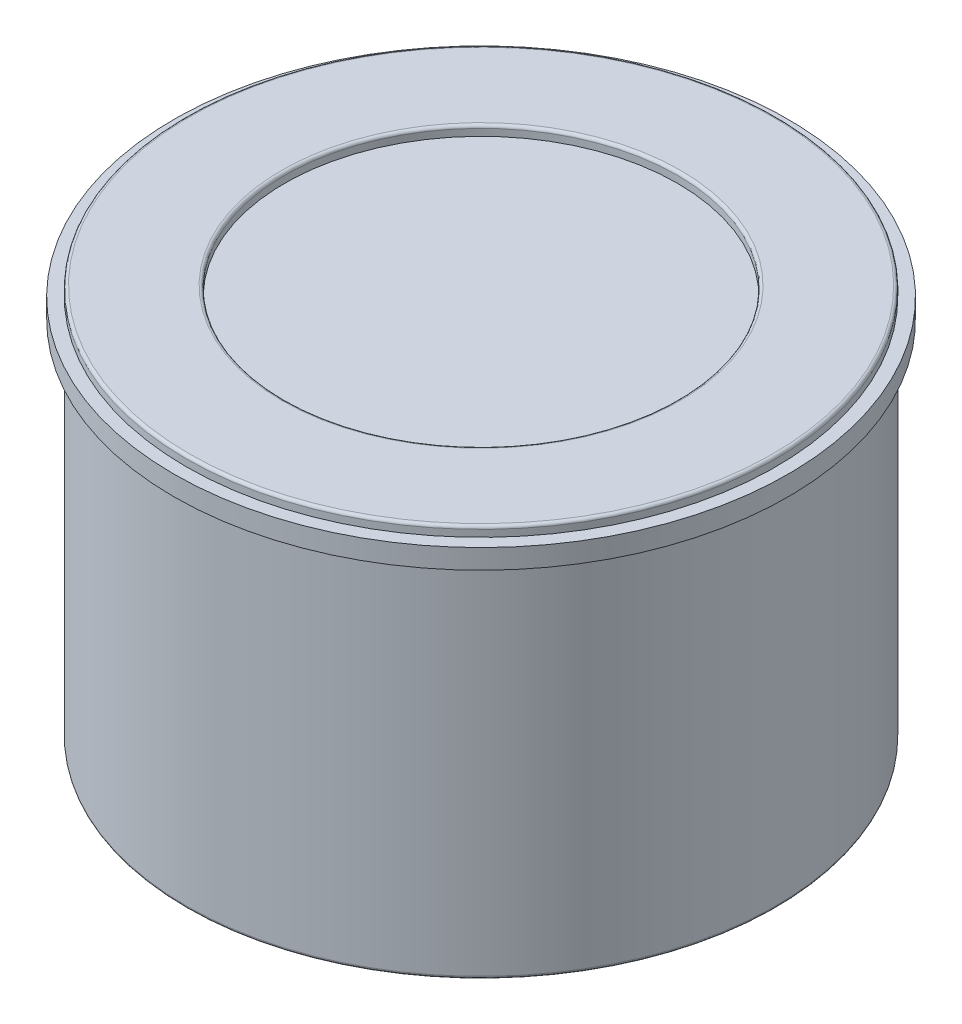
ISO-10303-21;
HEADER;
FILE_DESCRIPTION(('STEP AP214'),'2;1');
FILE_NAME('part.step','',(''),(''),'','','');
FILE_SCHEMA(('AUTOMOTIVE_DESIGN { 1 0 10303 214 1 1 1 1 }'));
ENDSEC;
DATA;
#1=APPLICATION_CONTEXT('core data for automotive mechanical design processes');
#2=APPLICATION_PROTOCOL_DEFINITION('international standard','automotive_design',2000,#1);
#3=PRODUCT_CONTEXT('',#1,'mechanical');
#4=PRODUCT('Part','Part','',(#3));
#5=PRODUCT_RELATED_PRODUCT_CATEGORY('part','',(#4));
#6=PRODUCT_DEFINITION_FORMATION('','',#4);
#7=PRODUCT_DEFINITION_CONTEXT('part definition',#1,'design');
#8=PRODUCT_DEFINITION('design','',#6,#7);
#9=PRODUCT_DEFINITION_SHAPE('','',#8);
#10=(LENGTH_UNIT() NAMED_UNIT(*) SI_UNIT(.MILLI.,.METRE.));
#11=(NAMED_UNIT(*) PLANE_ANGLE_UNIT() SI_UNIT($,.RADIAN.));
#12=(NAMED_UNIT(*) SI_UNIT($,.STERADIAN.) SOLID_ANGLE_UNIT());
#13=UNCERTAINTY_MEASURE_WITH_UNIT(LENGTH_MEASURE(1.E-05),#10,'distance_accuracy_value','');
#14=(GEOMETRIC_REPRESENTATION_CONTEXT(3) GLOBAL_UNCERTAINTY_ASSIGNED_CONTEXT((#13)) GLOBAL_UNIT_ASSIGNED_CONTEXT((#10,
#11,#12)) REPRESENTATION_CONTEXT('',''));
#15=CARTESIAN_POINT('',(0.,0.,0.));
#16=DIRECTION('',(0.,0.,1.));
#17=DIRECTION('',(1.,0.,0.));
#18=AXIS2_PLACEMENT_3D('',#15,#16,#17);
#19=CARTESIAN_POINT('',(0.,20.,0.));
#20=DIRECTION('',(0.,-1.,0.));
#21=DIRECTION('',(0.,0.,-1.));
#22=AXIS2_PLACEMENT_3D('',#19,#20,#21);
#23=CYLINDRICAL_SURFACE('',#22,15.);
#24=CARTESIAN_POINT('',(0.,0.150000000000001,0.));
#25=DIRECTION('',(0.,1.,0.));
#26=DIRECTION('',(0.,0.,1.));
#27=AXIS2_PLACEMENT_3D('',#24,#25,#26);
#28=CIRCLE('',#27,15.);
#29=CARTESIAN_POINT('',(0.,0.150000000000001,15.));
#30=VERTEX_POINT('',#29);
#31=EDGE_CURVE('E141',#30,#30,#28,.T.);
#32=ORIENTED_EDGE('',*,*,#31,.T.);
#33=EDGE_LOOP('',(#32));
#34=FACE_BOUND('',#33,.T.);
#35=CARTESIAN_POINT('',(0.,18.5,0.));
#36=DIRECTION('',(0.,1.,0.));
#37=DIRECTION('',(0.,0.,1.));
#38=AXIS2_PLACEMENT_3D('',#35,#36,#37);
#39=CIRCLE('',#38,15.);
#40=CARTESIAN_POINT('',(0.,18.5,15.));
#41=VERTEX_POINT('',#40);
#42=EDGE_CURVE('E11',#41,#41,#39,.T.);
#43=ORIENTED_EDGE('',*,*,#42,.F.);
#44=EDGE_LOOP('',(#43));
#45=FACE_BOUND('',#44,.T.);
#46=ADVANCED_FACE('F36',(#34,#45),#23,.T.);
#47=CARTESIAN_POINT('',(0.,2.99999999999999,0.));
#48=DIRECTION('',(0.,-1.,0.));
#49=DIRECTION('',(0.,0.,-1.));
#50=AXIS2_PLACEMENT_3D('',#47,#48,#49);
#51=PLANE('',#50);
#52=CARTESIAN_POINT('',(0.,2.99999999999999,0.));
#53=DIRECTION('',(0.,-1.,0.));
#54=DIRECTION('',(0.,0.,-1.));
#55=AXIS2_PLACEMENT_3D('',#52,#53,#54);
#56=CIRCLE('',#55,10.);
#57=CARTESIAN_POINT('',(0.,2.99999999999999,-10.));
#58=VERTEX_POINT('',#57);
#59=EDGE_CURVE('E99',#58,#58,#56,.T.);
#60=ORIENTED_EDGE('',*,*,#59,.T.);
#61=EDGE_LOOP('',(#60));
#62=FACE_BOUND('',#61,.T.);
#63=DIRECTION('',(-1.,0.,0.));
#64=VECTOR('',#63,1.);
#65=CARTESIAN_POINT('',(-2.,2.99999999999999,2.));
#66=LINE('',#65,#64);
#67=CARTESIAN_POINT('',(2.,2.99999999999999,2.));
#68=VERTEX_POINT('',#67);
#69=CARTESIAN_POINT('',(-2.,2.99999999999999,2.));
#70=VERTEX_POINT('',#69);
#71=EDGE_CURVE('E94',#68,#70,#66,.T.);
#72=ORIENTED_EDGE('',*,*,#71,.F.);
#73=DIRECTION('',(0.,0.,1.));
#74=VECTOR('',#73,1.);
#75=CARTESIAN_POINT('',(2.,2.99999999999999,2.));
#76=LINE('',#75,#74);
#77=CARTESIAN_POINT('',(2.,2.99999999999999,-2.));
#78=VERTEX_POINT('',#77);
#79=EDGE_CURVE('E103',#78,#68,#76,.T.);
#80=ORIENTED_EDGE('',*,*,#79,.F.);
#81=DIRECTION('',(1.,0.,0.));
#82=VECTOR('',#81,1.);
#83=CARTESIAN_POINT('',(-2.,2.99999999999999,-2.));
#84=LINE('',#83,#82);
#85=CARTESIAN_POINT('',(-2.,2.99999999999999,-2.));
#86=VERTEX_POINT('',#85);
#87=EDGE_CURVE('E116',#86,#78,#84,.T.);
#88=ORIENTED_EDGE('',*,*,#87,.F.);
#89=DIRECTION('',(0.,0.,-1.));
#90=VECTOR('',#89,1.);
#91=CARTESIAN_POINT('',(-2.,2.99999999999999,2.));
#92=LINE('',#91,#90);
#93=EDGE_CURVE('E114',#70,#86,#92,.T.);
#94=ORIENTED_EDGE('',*,*,#93,.F.);
#95=EDGE_LOOP('',(#72,#80,#88,#94));
#96=FACE_BOUND('',#95,.T.);
#97=ADVANCED_FACE('F112',(#62,#96),#51,.T.);
#98=CARTESIAN_POINT('',(0.,0.,0.));
#99=DIRECTION('',(0.,1.,0.));
#100=DIRECTION('',(0.,0.,1.));
#101=AXIS2_PLACEMENT_3D('',#98,#99,#100);
#102=PLANE('',#101);
#103=CARTESIAN_POINT('',(0.,0.,0.));
#104=DIRECTION('',(0.,1.,0.));
#105=DIRECTION('',(0.,0.,1.));
#106=AXIS2_PLACEMENT_3D('',#103,#104,#105);
#107=CIRCLE('',#106,14.85);
#108=CARTESIAN_POINT('',(0.,0.,14.85));
#109=VERTEX_POINT('',#108);
#110=EDGE_CURVE('E150',#109,#109,#107,.F.);
#111=ORIENTED_EDGE('',*,*,#110,.T.);
#112=EDGE_LOOP('',(#111));
#113=FACE_BOUND('',#112,.T.);
#114=CARTESIAN_POINT('',(0.,0.,0.));
#115=DIRECTION('',(0.,1.,0.));
#116=DIRECTION('',(0.,0.,1.));
#117=AXIS2_PLACEMENT_3D('',#114,#115,#116);
#118=CIRCLE('',#117,10.15);
#119=CARTESIAN_POINT('',(0.,0.,10.15));
#120=VERTEX_POINT('',#119);
#121=EDGE_CURVE('E147',#120,#120,#118,.T.);
#122=ORIENTED_EDGE('',*,*,#121,.T.);
#123=EDGE_LOOP('',(#122));
#124=FACE_BOUND('',#123,.T.);
#125=ADVANCED_FACE('F218',(#113,#124),#102,.F.);
#126=CARTESIAN_POINT('',(0.,2.99999999999999,0.));
#127=DIRECTION('',(0.,-1.,0.));
#128=DIRECTION('',(0.,0.,-1.));
#129=AXIS2_PLACEMENT_3D('',#126,#127,#128);
#130=CYLINDRICAL_SURFACE('',#129,10.);
#131=CARTESIAN_POINT('',(0.,0.15,0.));
#132=DIRECTION('',(0.,1.,0.));
#133=DIRECTION('',(0.,0.,1.));
#134=AXIS2_PLACEMENT_3D('',#131,#132,#133);
#135=CIRCLE('',#134,10.);
#136=CARTESIAN_POINT('',(0.,0.15,10.));
#137=VERTEX_POINT('',#136);
#138=EDGE_CURVE('E153',#137,#137,#135,.F.);
#139=ORIENTED_EDGE('',*,*,#138,.T.);
#140=EDGE_LOOP('',(#139));
#141=FACE_BOUND('',#140,.T.);
#142=ORIENTED_EDGE('',*,*,#59,.F.);
#143=EDGE_LOOP('',(#142));
#144=FACE_BOUND('',#143,.T.);
#145=ADVANCED_FACE('F264',(#141,#144),#130,.F.);
#146=CARTESIAN_POINT('',(2.,-4.,2.));
#147=DIRECTION('',(-1.,0.,0.));
#148=DIRECTION('',(0.,0.,1.));
#149=AXIS2_PLACEMENT_3D('',#146,#147,#148);
#150=PLANE('',#149);
#151=CARTESIAN_POINT('',(2.,-2.,0.));
#152=DIRECTION('',(1.,0.,0.));
#153=DIRECTION('',(0.,0.,-1.));
#154=AXIS2_PLACEMENT_3D('',#151,#152,#153);
#155=CIRCLE('',#154,1.5);
#156=CARTESIAN_POINT('',(2.,-2.,-1.49999999999999));
#157=VERTEX_POINT('',#156);
#158=EDGE_CURVE('E132',#157,#157,#155,.T.);
#159=ORIENTED_EDGE('',*,*,#158,.F.);
#160=EDGE_LOOP('',(#159));
#161=FACE_BOUND('',#160,.T.);
#162=DIRECTION('',(0.,0.,1.));
#163=VECTOR('',#162,1.);
#164=CARTESIAN_POINT('',(2.,-4.,2.));
#165=LINE('',#164,#163);
#166=CARTESIAN_POINT('',(2.,-4.,-1.85));
#167=VERTEX_POINT('',#166);
#168=CARTESIAN_POINT('',(2.,-4.,1.85));
#169=VERTEX_POINT('',#168);
#170=EDGE_CURVE('E121',#167,#169,#165,.T.);
#171=ORIENTED_EDGE('',*,*,#170,.F.);
#172=CARTESIAN_POINT('',(2.,-3.85,-1.85));
#173=DIRECTION('',(-1.,0.,0.));
#174=DIRECTION('',(0.,0.,1.));
#175=AXIS2_PLACEMENT_3D('',#172,#173,#174);
#176=CIRCLE('',#175,0.15);
#177=CARTESIAN_POINT('',(2.,-3.85,-2.));
#178=VERTEX_POINT('',#177);
#179=EDGE_CURVE('E164',#167,#178,#176,.F.);
#180=ORIENTED_EDGE('',*,*,#179,.T.);
#181=DIRECTION('',(0.,1.,0.));
#182=VECTOR('',#181,1.);
#183=CARTESIAN_POINT('',(2.,-4.,-2.));
#184=LINE('',#183,#182);
#185=EDGE_CURVE('E106',#178,#78,#184,.T.);
#186=ORIENTED_EDGE('',*,*,#185,.T.);
#187=ORIENTED_EDGE('',*,*,#79,.T.);
#188=DIRECTION('',(0.,1.,0.));
#189=VECTOR('',#188,1.);
#190=CARTESIAN_POINT('',(2.,-4.,2.));
#191=LINE('',#190,#189);
#192=CARTESIAN_POINT('',(2.,-3.85,2.));
#193=VERTEX_POINT('',#192);
#194=EDGE_CURVE('E90',#193,#68,#191,.T.);
#195=ORIENTED_EDGE('',*,*,#194,.F.);
#196=CARTESIAN_POINT('',(2.,-3.85,1.85));
#197=DIRECTION('',(-1.,0.,0.));
#198=DIRECTION('',(0.,0.,1.));
#199=AXIS2_PLACEMENT_3D('',#196,#197,#198);
#200=CIRCLE('',#199,0.15);
#201=EDGE_CURVE('E162',#193,#169,#200,.F.);
#202=ORIENTED_EDGE('',*,*,#201,.T.);
#203=EDGE_LOOP('',(#171,#180,#186,#187,#195,#202));
#204=FACE_BOUND('',#203,.T.);
#205=ADVANCED_FACE('F105',(#161,#204),#150,.F.);
#206=CARTESIAN_POINT('',(-2.,-4.,2.));
#207=DIRECTION('',(0.,0.,-1.));
#208=DIRECTION('',(-1.,0.,0.));
#209=AXIS2_PLACEMENT_3D('',#206,#207,#208);
#210=PLANE('',#209);
#211=DIRECTION('',(0.,1.,0.));
#212=VECTOR('',#211,1.);
#213=CARTESIAN_POINT('',(-2.,-4.,2.));
#214=LINE('',#213,#212);
#215=CARTESIAN_POINT('',(-2.,-3.85,2.));
#216=VERTEX_POINT('',#215);
#217=EDGE_CURVE('E100',#216,#70,#214,.T.);
#218=ORIENTED_EDGE('',*,*,#217,.F.);
#219=DIRECTION('',(-1.,0.,0.));
#220=VECTOR('',#219,1.);
#221=CARTESIAN_POINT('',(2.,-3.85,2.));
#222=LINE('',#221,#220);
#223=EDGE_CURVE('E44',#216,#193,#222,.F.);
#224=ORIENTED_EDGE('',*,*,#223,.T.);
#225=ORIENTED_EDGE('',*,*,#194,.T.);
#226=ORIENTED_EDGE('',*,*,#71,.T.);
#227=EDGE_LOOP('',(#218,#224,#225,#226));
#228=FACE_BOUND('',#227,.T.);
#229=ADVANCED_FACE('F92',(#228),#210,.F.);
#230=CARTESIAN_POINT('',(-2.,-4.,2.));
#231=DIRECTION('',(1.,0.,0.));
#232=DIRECTION('',(0.,0.,-1.));
#233=AXIS2_PLACEMENT_3D('',#230,#231,#232);
#234=PLANE('',#233);
#235=CARTESIAN_POINT('',(-2.,-2.,0.));
#236=DIRECTION('',(1.,0.,0.));
#237=DIRECTION('',(0.,0.,-1.));
#238=AXIS2_PLACEMENT_3D('',#235,#236,#237);
#239=CIRCLE('',#238,1.5);
#240=CARTESIAN_POINT('',(-2.,-2.,-1.49999999999999));
#241=VERTEX_POINT('',#240);
#242=EDGE_CURVE('E110',#241,#241,#239,.T.);
#243=ORIENTED_EDGE('',*,*,#242,.T.);
#244=EDGE_LOOP('',(#243));
#245=FACE_BOUND('',#244,.T.);
#246=DIRECTION('',(0.,1.,0.));
#247=VECTOR('',#246,1.);
#248=CARTESIAN_POINT('',(-2.,-4.,-2.));
#249=LINE('',#248,#247);
#250=CARTESIAN_POINT('',(-2.,-3.85,-2.));
#251=VERTEX_POINT('',#250);
#252=EDGE_CURVE('E123',#251,#86,#249,.T.);
#253=ORIENTED_EDGE('',*,*,#252,.F.);
#254=CARTESIAN_POINT('',(-2.,-3.85,-1.85));
#255=DIRECTION('',(1.,0.,0.));
#256=DIRECTION('',(0.,0.,-1.));
#257=AXIS2_PLACEMENT_3D('',#254,#255,#256);
#258=CIRCLE('',#257,0.15);
#259=CARTESIAN_POINT('',(-2.,-4.,-1.85));
#260=VERTEX_POINT('',#259);
#261=EDGE_CURVE('E168',#251,#260,#258,.F.);
#262=ORIENTED_EDGE('',*,*,#261,.T.);
#263=DIRECTION('',(0.,0.,-1.));
#264=VECTOR('',#263,1.);
#265=CARTESIAN_POINT('',(-2.,-4.,2.));
#266=LINE('',#265,#264);
#267=CARTESIAN_POINT('',(-2.,-4.,1.85));
#268=VERTEX_POINT('',#267);
#269=EDGE_CURVE('E124',#268,#260,#266,.T.);
#270=ORIENTED_EDGE('',*,*,#269,.F.);
#271=CARTESIAN_POINT('',(-2.,-3.85,1.85));
#272=DIRECTION('',(1.,0.,0.));
#273=DIRECTION('',(0.,0.,-1.));
#274=AXIS2_PLACEMENT_3D('',#271,#272,#273);
#275=CIRCLE('',#274,0.15);
#276=EDGE_CURVE('E51',#268,#216,#275,.F.);
#277=ORIENTED_EDGE('',*,*,#276,.T.);
#278=ORIENTED_EDGE('',*,*,#217,.T.);
#279=ORIENTED_EDGE('',*,*,#93,.T.);
#280=EDGE_LOOP('',(#253,#262,#270,#277,#278,#279));
#281=FACE_BOUND('',#280,.T.);
#282=ADVANCED_FACE('F198',(#245,#281),#234,.F.);
#283=CARTESIAN_POINT('',(-2.,-4.,-2.));
#284=DIRECTION('',(0.,0.,1.));
#285=DIRECTION('',(1.,0.,0.));
#286=AXIS2_PLACEMENT_3D('',#283,#284,#285);
#287=PLANE('',#286);
#288=ORIENTED_EDGE('',*,*,#185,.F.);
#289=DIRECTION('',(1.,0.,0.));
#290=VECTOR('',#289,1.);
#291=CARTESIAN_POINT('',(-2.,-3.85,-2.));
#292=LINE('',#291,#290);
#293=EDGE_CURVE('E59',#178,#251,#292,.F.);
#294=ORIENTED_EDGE('',*,*,#293,.T.);
#295=ORIENTED_EDGE('',*,*,#252,.T.);
#296=ORIENTED_EDGE('',*,*,#87,.T.);
#297=EDGE_LOOP('',(#288,#294,#295,#296));
#298=FACE_BOUND('',#297,.T.);
#299=ADVANCED_FACE('F197',(#298),#287,.F.);
#300=CARTESIAN_POINT('',(0.,-4.,0.));
#301=DIRECTION('',(0.,-1.,0.));
#302=DIRECTION('',(0.,0.,-1.));
#303=AXIS2_PLACEMENT_3D('',#300,#301,#302);
#304=PLANE('',#303);
#305=ORIENTED_EDGE('',*,*,#269,.T.);
#306=DIRECTION('',(1.,0.,0.));
#307=VECTOR('',#306,1.);
#308=CARTESIAN_POINT('',(2.,-4.,-1.85));
#309=LINE('',#308,#307);
#310=EDGE_CURVE('E159',#260,#167,#309,.T.);
#311=ORIENTED_EDGE('',*,*,#310,.T.);
#312=ORIENTED_EDGE('',*,*,#170,.T.);
#313=DIRECTION('',(-1.,0.,0.));
#314=VECTOR('',#313,1.);
#315=CARTESIAN_POINT('',(-2.,-4.,1.85));
#316=LINE('',#315,#314);
#317=EDGE_CURVE('E156',#169,#268,#316,.T.);
#318=ORIENTED_EDGE('',*,*,#317,.T.);
#319=EDGE_LOOP('',(#305,#311,#312,#318));
#320=FACE_BOUND('',#319,.T.);
#321=ADVANCED_FACE('F192',(#320),#304,.T.);
#322=CARTESIAN_POINT('',(-4.99999999999999,-2.,0.));
#323=DIRECTION('',(1.,0.,0.));
#324=DIRECTION('',(0.,0.,-1.));
#325=AXIS2_PLACEMENT_3D('',#322,#323,#324);
#326=CYLINDRICAL_SURFACE('',#325,1.5);
#327=ORIENTED_EDGE('',*,*,#158,.T.);
#328=EDGE_LOOP('',(#327));
#329=FACE_BOUND('',#328,.T.);
#330=ORIENTED_EDGE('',*,*,#242,.F.);
#331=EDGE_LOOP('',(#330));
#332=FACE_BOUND('',#331,.T.);
#333=ADVANCED_FACE('F254',(#329,#332),#326,.F.);
#334=CARTESIAN_POINT('',(0.,0.150000000000001,0.));
#335=DIRECTION('',(0.,1.,0.));
#336=DIRECTION('',(0.,0.,1.));
#337=AXIS2_PLACEMENT_3D('',#334,#335,#336);
#338=TOROIDAL_SURFACE('',#337,14.85,0.15);
#339=ORIENTED_EDGE('',*,*,#110,.F.);
#340=EDGE_LOOP('',(#339));
#341=FACE_BOUND('',#340,.T.);
#342=ORIENTED_EDGE('',*,*,#31,.F.);
#343=EDGE_LOOP('',(#342));
#344=FACE_BOUND('',#343,.T.);
#345=ADVANCED_FACE('F251',(#341,#344),#338,.T.);
#346=CARTESIAN_POINT('',(0.,0.15,0.));
#347=DIRECTION('',(0.,1.,0.));
#348=DIRECTION('',(0.,0.,1.));
#349=AXIS2_PLACEMENT_3D('',#346,#347,#348);
#350=TOROIDAL_SURFACE('',#349,10.15,0.15);
#351=ORIENTED_EDGE('',*,*,#121,.F.);
#352=EDGE_LOOP('',(#351));
#353=FACE_BOUND('',#352,.T.);
#354=ORIENTED_EDGE('',*,*,#138,.F.);
#355=EDGE_LOOP('',(#354));
#356=FACE_BOUND('',#355,.T.);
#357=ADVANCED_FACE('F210',(#353,#356),#350,.T.);
#358=CARTESIAN_POINT('',(0.,-3.85,-1.85));
#359=DIRECTION('',(-1.,0.,0.));
#360=DIRECTION('',(0.,0.,1.));
#361=AXIS2_PLACEMENT_3D('',#358,#359,#360);
#362=CYLINDRICAL_SURFACE('',#361,0.15);
#363=ORIENTED_EDGE('',*,*,#261,.F.);
#364=ORIENTED_EDGE('',*,*,#293,.F.);
#365=ORIENTED_EDGE('',*,*,#179,.F.);
#366=ORIENTED_EDGE('',*,*,#310,.F.);
#367=EDGE_LOOP('',(#363,#364,#365,#366));
#368=FACE_BOUND('',#367,.T.);
#369=ADVANCED_FACE('F196',(#368),#362,.T.);
#370=CARTESIAN_POINT('',(0.,-3.85,1.85));
#371=DIRECTION('',(1.,0.,0.));
#372=DIRECTION('',(0.,0.,-1.));
#373=AXIS2_PLACEMENT_3D('',#370,#371,#372);
#374=CYLINDRICAL_SURFACE('',#373,0.15);
#375=ORIENTED_EDGE('',*,*,#201,.F.);
#376=ORIENTED_EDGE('',*,*,#223,.F.);
#377=ORIENTED_EDGE('',*,*,#276,.F.);
#378=ORIENTED_EDGE('',*,*,#317,.F.);
#379=EDGE_LOOP('',(#375,#376,#377,#378));
#380=FACE_BOUND('',#379,.T.);
#381=ADVANCED_FACE('F38',(#380),#374,.T.);
#382=CARTESIAN_POINT('',(0.,19.5,0.));
#383=DIRECTION('',(0.,1.,0.));
#384=DIRECTION('',(0.,0.,1.));
#385=AXIS2_PLACEMENT_3D('',#382,#383,#384);
#386=PLANE('',#385);
#387=CARTESIAN_POINT('',(0.,19.5,0.));
#388=DIRECTION('',(0.,1.,0.));
#389=DIRECTION('',(0.,0.,1.));
#390=AXIS2_PLACEMENT_3D('',#387,#388,#389);
#391=CIRCLE('',#390,15.6367101872443);
#392=CARTESIAN_POINT('',(0.,19.5,15.6367101872443));
#393=VERTEX_POINT('',#392);
#394=EDGE_CURVE('E179',#393,#393,#391,.T.);
#395=ORIENTED_EDGE('',*,*,#394,.T.);
#396=EDGE_LOOP('',(#395));
#397=FACE_BOUND('',#396,.T.);
#398=CARTESIAN_POINT('',(0.,19.5,0.));
#399=DIRECTION('',(0.,1.,0.));
#400=DIRECTION('',(0.,0.,1.));
#401=AXIS2_PLACEMENT_3D('',#398,#399,#400);
#402=CIRCLE('',#401,15.);
#403=CARTESIAN_POINT('',(0.,19.5,15.));
#404=VERTEX_POINT('',#403);
#405=EDGE_CURVE('E172',#404,#404,#402,.T.);
#406=ORIENTED_EDGE('',*,*,#405,.F.);
#407=EDGE_LOOP('',(#406));
#408=FACE_BOUND('',#407,.T.);
#409=ADVANCED_FACE('F201',(#397,#408),#386,.T.);
#410=CARTESIAN_POINT('',(0.,18.5,0.));
#411=DIRECTION('',(0.,1.,0.));
#412=DIRECTION('',(0.,0.,1.));
#413=AXIS2_PLACEMENT_3D('',#410,#411,#412);
#414=CYLINDRICAL_SURFACE('',#413,15.6367101872443);
#415=CARTESIAN_POINT('',(0.,18.5,0.));
#416=DIRECTION('',(0.,1.,0.));
#417=DIRECTION('',(0.,0.,1.));
#418=AXIS2_PLACEMENT_3D('',#415,#416,#417);
#419=CIRCLE('',#418,15.6367101872443);
#420=CARTESIAN_POINT('',(0.,18.5,15.6367101872443));
#421=VERTEX_POINT('',#420);
#422=EDGE_CURVE('E173',#421,#421,#419,.T.);
#423=ORIENTED_EDGE('',*,*,#422,.T.);
#424=EDGE_LOOP('',(#423));
#425=FACE_BOUND('',#424,.T.);
#426=ORIENTED_EDGE('',*,*,#394,.F.);
#427=EDGE_LOOP('',(#426));
#428=FACE_BOUND('',#427,.T.);
#429=ADVANCED_FACE('F206',(#425,#428),#414,.T.);
#430=CARTESIAN_POINT('',(0.,18.5,0.));
#431=DIRECTION('',(0.,1.,0.));
#432=DIRECTION('',(0.,0.,1.));
#433=AXIS2_PLACEMENT_3D('',#430,#431,#432);
#434=PLANE('',#433);
#435=ORIENTED_EDGE('',*,*,#42,.T.);
#436=EDGE_LOOP('',(#435));
#437=FACE_BOUND('',#436,.T.);
#438=ORIENTED_EDGE('',*,*,#422,.F.);
#439=EDGE_LOOP('',(#438));
#440=FACE_BOUND('',#439,.T.);
#441=ADVANCED_FACE('F235',(#437,#440),#434,.F.);
#442=CARTESIAN_POINT('',(0.,19.85,0.));
#443=DIRECTION('',(0.,1.,0.));
#444=DIRECTION('',(0.,0.,1.));
#445=AXIS2_PLACEMENT_3D('',#442,#443,#444);
#446=TOROIDAL_SURFACE('',#445,14.85,0.15);
#447=CARTESIAN_POINT('',(0.,19.85,0.));
#448=DIRECTION('',(0.,1.,0.));
#449=DIRECTION('',(0.,0.,1.));
#450=AXIS2_PLACEMENT_3D('',#447,#448,#449);
#451=CIRCLE('',#450,15.);
#452=CARTESIAN_POINT('',(0.,19.85,15.));
#453=VERTEX_POINT('',#452);
#454=EDGE_CURVE('E144',#453,#453,#451,.F.);
#455=ORIENTED_EDGE('',*,*,#454,.F.);
#456=EDGE_LOOP('',(#455));
#457=FACE_BOUND('',#456,.T.);
#458=CARTESIAN_POINT('',(0.,20.,0.));
#459=DIRECTION('',(0.,1.,0.));
#460=DIRECTION('',(0.,0.,1.));
#461=AXIS2_PLACEMENT_3D('',#458,#459,#460);
#462=CIRCLE('',#461,14.85);
#463=CARTESIAN_POINT('',(0.,20.,14.85));
#464=VERTEX_POINT('',#463);
#465=EDGE_CURVE('E135',#464,#464,#462,.T.);
#466=ORIENTED_EDGE('',*,*,#465,.F.);
#467=EDGE_LOOP('',(#466));
#468=FACE_BOUND('',#467,.T.);
#469=ADVANCED_FACE('F226',(#457,#468),#446,.T.);
#470=ORIENTED_EDGE('',*,*,#405,.T.);
#471=EDGE_LOOP('',(#470));
#472=FACE_BOUND('',#471,.T.);
#473=ORIENTED_EDGE('',*,*,#454,.T.);
#474=EDGE_LOOP('',(#473));
#475=FACE_BOUND('',#474,.T.);
#476=ADVANCED_FACE('F214',(#472,#475),#23,.T.);
#477=CARTESIAN_POINT('',(0.,20.,0.));
#478=DIRECTION('',(0.,1.,0.));
#479=DIRECTION('',(0.,0.,1.));
#480=AXIS2_PLACEMENT_3D('',#477,#478,#479);
#481=PLANE('',#480);
#482=CARTESIAN_POINT('',(0.,20.,0.));
#483=DIRECTION('',(0.,1.,0.));
#484=DIRECTION('',(0.,0.,1.));
#485=AXIS2_PLACEMENT_3D('',#482,#483,#484);
#486=CIRCLE('',#485,10.15);
#487=CARTESIAN_POINT('',(0.,20.,10.15));
#488=VERTEX_POINT('',#487);
#489=EDGE_CURVE('E138',#488,#488,#486,.F.);
#490=ORIENTED_EDGE('',*,*,#489,.T.);
#491=EDGE_LOOP('',(#490));
#492=FACE_BOUND('',#491,.T.);
#493=ORIENTED_EDGE('',*,*,#465,.T.);
#494=EDGE_LOOP('',(#493));
#495=FACE_BOUND('',#494,.T.);
#496=ADVANCED_FACE('F225',(#492,#495),#481,.T.);
#497=CARTESIAN_POINT('',(0.,19.85,0.));
#498=DIRECTION('',(0.,1.,0.));
#499=DIRECTION('',(0.,0.,1.));
#500=AXIS2_PLACEMENT_3D('',#497,#498,#499);
#501=TOROIDAL_SURFACE('',#500,10.15,0.15);
#502=ORIENTED_EDGE('',*,*,#489,.F.);
#503=EDGE_LOOP('',(#502));
#504=FACE_BOUND('',#503,.T.);
#505=CARTESIAN_POINT('',(0.,19.85,0.));
#506=DIRECTION('',(0.,1.,0.));
#507=DIRECTION('',(0.,0.,1.));
#508=AXIS2_PLACEMENT_3D('',#505,#506,#507);
#509=CIRCLE('',#508,10.);
#510=CARTESIAN_POINT('',(0.,19.85,10.));
#511=VERTEX_POINT('',#510);
#512=EDGE_CURVE('E129',#511,#511,#509,.T.);
#513=ORIENTED_EDGE('',*,*,#512,.F.);
#514=EDGE_LOOP('',(#513));
#515=FACE_BOUND('',#514,.T.);
#516=ADVANCED_FACE('F232',(#504,#515),#501,.T.);
#517=CARTESIAN_POINT('',(0.,19.,0.));
#518=DIRECTION('',(0.,1.,0.));
#519=DIRECTION('',(0.,0.,1.));
#520=AXIS2_PLACEMENT_3D('',#517,#518,#519);
#521=CYLINDRICAL_SURFACE('',#520,10.);
#522=CARTESIAN_POINT('',(0.,19.5,0.));
#523=DIRECTION('',(0.,1.,0.));
#524=DIRECTION('',(0.,0.,1.));
#525=AXIS2_PLACEMENT_3D('',#522,#523,#524);
#526=CIRCLE('',#525,10.);
#527=CARTESIAN_POINT('',(0.,19.5,10.));
#528=VERTEX_POINT('',#527);
#529=EDGE_CURVE('E170',#528,#528,#526,.F.);
#530=ORIENTED_EDGE('',*,*,#529,.T.);
#531=EDGE_LOOP('',(#530));
#532=FACE_BOUND('',#531,.T.);
#533=ORIENTED_EDGE('',*,*,#512,.T.);
#534=EDGE_LOOP('',(#533));
#535=FACE_BOUND('',#534,.T.);
#536=ADVANCED_FACE('F277',(#532,#535),#521,.F.);
#537=ORIENTED_EDGE('',*,*,#529,.F.);
#538=EDGE_LOOP('',(#537));
#539=FACE_BOUND('',#538,.T.);
#540=ADVANCED_FACE('F209',(#539),#386,.T.);
#541=CLOSED_SHELL('',(#46,#97,#125,#145,#205,#229,#282,#299,#321,#333,#345,#357,#369,#381,#409,
#429,#441,#469,#476,#496,#516,#536,#540));
#542=MANIFOLD_SOLID_BREP('B2',#541);
#543=ADVANCED_BREP_SHAPE_REPRESENTATION('',(#18,#542),#14);
#544=SHAPE_DEFINITION_REPRESENTATION(#9,#543);
ENDSEC;
END-ISO-10303-21;
